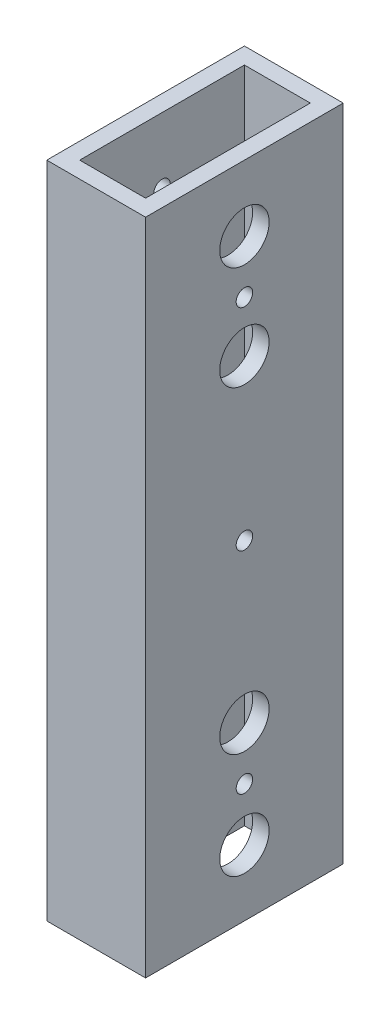
ISO-10303-21;
HEADER;
FILE_DESCRIPTION(('STEP AP214'),'2;1');
FILE_NAME('part.step','',(''),(''),'','','');
FILE_SCHEMA(('AUTOMOTIVE_DESIGN { 1 0 10303 214 1 1 1 1 }'));
ENDSEC;
DATA;
#1=APPLICATION_CONTEXT('core data for automotive mechanical design processes');
#2=APPLICATION_PROTOCOL_DEFINITION('international standard','automotive_design',2000,#1);
#3=PRODUCT_CONTEXT('',#1,'mechanical');
#4=PRODUCT('Part','Part','',(#3));
#5=PRODUCT_RELATED_PRODUCT_CATEGORY('part','',(#4));
#6=PRODUCT_DEFINITION_FORMATION('','',#4);
#7=PRODUCT_DEFINITION_CONTEXT('part definition',#1,'design');
#8=PRODUCT_DEFINITION('design','',#6,#7);
#9=PRODUCT_DEFINITION_SHAPE('','',#8);
#10=(LENGTH_UNIT() NAMED_UNIT(*) SI_UNIT(.MILLI.,.METRE.));
#11=(NAMED_UNIT(*) PLANE_ANGLE_UNIT() SI_UNIT($,.RADIAN.));
#12=(NAMED_UNIT(*) SI_UNIT($,.STERADIAN.) SOLID_ANGLE_UNIT());
#13=UNCERTAINTY_MEASURE_WITH_UNIT(LENGTH_MEASURE(1.E-05),#10,'distance_accuracy_value','');
#14=(GEOMETRIC_REPRESENTATION_CONTEXT(3) GLOBAL_UNCERTAINTY_ASSIGNED_CONTEXT((#13)) GLOBAL_UNIT_ASSIGNED_CONTEXT((#10,
#11,#12)) REPRESENTATION_CONTEXT('',''));
#15=CARTESIAN_POINT('',(0.,0.,0.));
#16=DIRECTION('',(0.,0.,1.));
#17=DIRECTION('',(1.,0.,0.));
#18=AXIS2_PLACEMENT_3D('',#15,#16,#17);
#19=CARTESIAN_POINT('',(0.,127.,0.));
#20=DIRECTION('',(0.,-1.,0.));
#21=DIRECTION('',(0.,0.,-1.));
#22=AXIS2_PLACEMENT_3D('',#19,#20,#21);
#23=PLANE('',#22);
#24=DIRECTION('',(0.,0.,1.));
#25=VECTOR('',#24,1.);
#26=CARTESIAN_POINT('',(0.,127.,0.));
#27=LINE('',#26,#25);
#28=CARTESIAN_POINT('',(0.,127.,-38.1));
#29=VERTEX_POINT('',#28);
#30=CARTESIAN_POINT('',(0.,127.,0.));
#31=VERTEX_POINT('',#30);
#32=EDGE_CURVE('E172',#29,#31,#27,.T.);
#33=ORIENTED_EDGE('',*,*,#32,.T.);
#34=DIRECTION('',(1.,0.,0.));
#35=VECTOR('',#34,1.);
#36=CARTESIAN_POINT('',(0.,127.,0.));
#37=LINE('',#36,#35);
#38=CARTESIAN_POINT('',(19.05,127.,0.));
#39=VERTEX_POINT('',#38);
#40=EDGE_CURVE('E176',#31,#39,#37,.T.);
#41=ORIENTED_EDGE('',*,*,#40,.T.);
#42=DIRECTION('',(0.,0.,-1.));
#43=VECTOR('',#42,1.);
#44=CARTESIAN_POINT('',(19.05,127.,0.));
#45=LINE('',#44,#43);
#46=CARTESIAN_POINT('',(19.05,127.,-38.1));
#47=VERTEX_POINT('',#46);
#48=EDGE_CURVE('E180',#39,#47,#45,.T.);
#49=ORIENTED_EDGE('',*,*,#48,.T.);
#50=DIRECTION('',(-1.,0.,0.));
#51=VECTOR('',#50,1.);
#52=CARTESIAN_POINT('',(0.,127.,-38.1));
#53=LINE('',#52,#51);
#54=EDGE_CURVE('E182',#47,#29,#53,.T.);
#55=ORIENTED_EDGE('',*,*,#54,.T.);
#56=EDGE_LOOP('',(#33,#41,#49,#55));
#57=FACE_BOUND('',#56,.T.);
#58=DIRECTION('',(0.,0.,1.));
#59=VECTOR('',#58,1.);
#60=CARTESIAN_POINT('',(3.175,127.,-3.175));
#61=LINE('',#60,#59);
#62=CARTESIAN_POINT('',(3.175,127.,-34.925));
#63=VERTEX_POINT('',#62);
#64=CARTESIAN_POINT('',(3.175,127.,-3.175));
#65=VERTEX_POINT('',#64);
#66=EDGE_CURVE('E122',#63,#65,#61,.T.);
#67=ORIENTED_EDGE('',*,*,#66,.F.);
#68=DIRECTION('',(-1.,0.,0.));
#69=VECTOR('',#68,1.);
#70=CARTESIAN_POINT('',(3.175,127.,-34.925));
#71=LINE('',#70,#69);
#72=CARTESIAN_POINT('',(15.875,127.,-34.925));
#73=VERTEX_POINT('',#72);
#74=EDGE_CURVE('E149',#73,#63,#71,.T.);
#75=ORIENTED_EDGE('',*,*,#74,.F.);
#76=DIRECTION('',(0.,0.,-1.));
#77=VECTOR('',#76,1.);
#78=CARTESIAN_POINT('',(15.875,127.,-3.175));
#79=LINE('',#78,#77);
#80=CARTESIAN_POINT('',(15.875,127.,-3.175));
#81=VERTEX_POINT('',#80);
#82=EDGE_CURVE('E144',#81,#73,#79,.T.);
#83=ORIENTED_EDGE('',*,*,#82,.F.);
#84=DIRECTION('',(1.,0.,0.));
#85=VECTOR('',#84,1.);
#86=CARTESIAN_POINT('',(3.175,127.,-3.175));
#87=LINE('',#86,#85);
#88=EDGE_CURVE('E131',#65,#81,#87,.T.);
#89=ORIENTED_EDGE('',*,*,#88,.F.);
#90=EDGE_LOOP('',(#67,#75,#83,#89));
#91=FACE_BOUND('',#90,.T.);
#92=ADVANCED_FACE('F42',(#57,#91),#23,.F.);
#93=CARTESIAN_POINT('',(0.,0.,0.));
#94=DIRECTION('',(0.,-1.,0.));
#95=DIRECTION('',(0.,0.,-1.));
#96=AXIS2_PLACEMENT_3D('',#93,#94,#95);
#97=PLANE('',#96);
#98=DIRECTION('',(0.,0.,1.));
#99=VECTOR('',#98,1.);
#100=CARTESIAN_POINT('',(0.,0.,0.));
#101=LINE('',#100,#99);
#102=CARTESIAN_POINT('',(0.,0.,-38.1));
#103=VERTEX_POINT('',#102);
#104=CARTESIAN_POINT('',(0.,0.,0.));
#105=VERTEX_POINT('',#104);
#106=EDGE_CURVE('E140',#103,#105,#101,.T.);
#107=ORIENTED_EDGE('',*,*,#106,.F.);
#108=DIRECTION('',(-1.,0.,0.));
#109=VECTOR('',#108,1.);
#110=CARTESIAN_POINT('',(0.,0.,-38.1));
#111=LINE('',#110,#109);
#112=CARTESIAN_POINT('',(19.05,0.,-38.1));
#113=VERTEX_POINT('',#112);
#114=EDGE_CURVE('E177',#113,#103,#111,.T.);
#115=ORIENTED_EDGE('',*,*,#114,.F.);
#116=DIRECTION('',(0.,0.,-1.));
#117=VECTOR('',#116,1.);
#118=CARTESIAN_POINT('',(19.05,0.,0.));
#119=LINE('',#118,#117);
#120=CARTESIAN_POINT('',(19.05,0.,0.));
#121=VERTEX_POINT('',#120);
#122=EDGE_CURVE('E191',#121,#113,#119,.T.);
#123=ORIENTED_EDGE('',*,*,#122,.F.);
#124=DIRECTION('',(1.,0.,0.));
#125=VECTOR('',#124,1.);
#126=CARTESIAN_POINT('',(0.,0.,0.));
#127=LINE('',#126,#125);
#128=EDGE_CURVE('E188',#105,#121,#127,.T.);
#129=ORIENTED_EDGE('',*,*,#128,.F.);
#130=EDGE_LOOP('',(#107,#115,#123,#129));
#131=FACE_BOUND('',#130,.T.);
#132=DIRECTION('',(-1.,0.,0.));
#133=VECTOR('',#132,1.);
#134=CARTESIAN_POINT('',(3.175,0.,-34.925));
#135=LINE('',#134,#133);
#136=CARTESIAN_POINT('',(15.875,0.,-34.925));
#137=VERTEX_POINT('',#136);
#138=CARTESIAN_POINT('',(3.175,0.,-34.925));
#139=VERTEX_POINT('',#138);
#140=EDGE_CURVE('E132',#137,#139,#135,.T.);
#141=ORIENTED_EDGE('',*,*,#140,.T.);
#142=DIRECTION('',(0.,0.,1.));
#143=VECTOR('',#142,1.);
#144=CARTESIAN_POINT('',(3.175,0.,-3.175));
#145=LINE('',#144,#143);
#146=CARTESIAN_POINT('',(3.175,0.,-3.175));
#147=VERTEX_POINT('',#146);
#148=EDGE_CURVE('E71',#139,#147,#145,.T.);
#149=ORIENTED_EDGE('',*,*,#148,.T.);
#150=DIRECTION('',(1.,0.,0.));
#151=VECTOR('',#150,1.);
#152=CARTESIAN_POINT('',(3.175,0.,-3.175));
#153=LINE('',#152,#151);
#154=CARTESIAN_POINT('',(15.875,0.,-3.175));
#155=VERTEX_POINT('',#154);
#156=EDGE_CURVE('E138',#147,#155,#153,.T.);
#157=ORIENTED_EDGE('',*,*,#156,.T.);
#158=DIRECTION('',(0.,0.,-1.));
#159=VECTOR('',#158,1.);
#160=CARTESIAN_POINT('',(15.875,0.,-3.175));
#161=LINE('',#160,#159);
#162=EDGE_CURVE('E159',#155,#137,#161,.T.);
#163=ORIENTED_EDGE('',*,*,#162,.T.);
#164=EDGE_LOOP('',(#141,#149,#157,#163));
#165=FACE_BOUND('',#164,.T.);
#166=ADVANCED_FACE('F289',(#131,#165),#97,.T.);
#167=CARTESIAN_POINT('',(0.,127.,0.));
#168=DIRECTION('',(1.,0.,0.));
#169=DIRECTION('',(0.,0.,-1.));
#170=AXIS2_PLACEMENT_3D('',#167,#168,#169);
#171=PLANE('',#170);
#172=CARTESIAN_POINT('',(0.,104.120295878924,-19.05));
#173=DIRECTION('',(-1.,0.,0.));
#174=DIRECTION('',(0.,0.,1.));
#175=AXIS2_PLACEMENT_3D('',#172,#173,#174);
#176=CIRCLE('',#175,4.7625);
#177=CARTESIAN_POINT('',(0.,104.120295878924,-14.2875));
#178=VERTEX_POINT('',#177);
#179=EDGE_CURVE('E387',#178,#178,#176,.T.);
#180=ORIENTED_EDGE('',*,*,#179,.F.);
#181=EDGE_LOOP('',(#180));
#182=FACE_BOUND('',#181,.T.);
#183=CARTESIAN_POINT('',(0.,63.5,-19.05));
#184=DIRECTION('',(-1.,0.,0.));
#185=DIRECTION('',(0.,0.,1.));
#186=AXIS2_PLACEMENT_3D('',#183,#184,#185);
#187=CIRCLE('',#186,4.7625);
#188=CARTESIAN_POINT('',(0.,63.5,-14.2875));
#189=VERTEX_POINT('',#188);
#190=EDGE_CURVE('E397',#189,#189,#187,.T.);
#191=ORIENTED_EDGE('',*,*,#190,.F.);
#192=EDGE_LOOP('',(#191));
#193=FACE_BOUND('',#192,.T.);
#194=CARTESIAN_POINT('',(0.,22.8797041210764,-19.05));
#195=DIRECTION('',(-1.,0.,0.));
#196=DIRECTION('',(0.,0.,1.));
#197=AXIS2_PLACEMENT_3D('',#194,#195,#196);
#198=CIRCLE('',#197,4.7625);
#199=CARTESIAN_POINT('',(0.,22.8797041210764,-14.2875));
#200=VERTEX_POINT('',#199);
#201=EDGE_CURVE('E407',#200,#200,#198,.T.);
#202=ORIENTED_EDGE('',*,*,#201,.F.);
#203=EDGE_LOOP('',(#202));
#204=FACE_BOUND('',#203,.T.);
#205=CARTESIAN_POINT('',(0.,12.7,-19.05));
#206=DIRECTION('',(1.,0.,0.));
#207=DIRECTION('',(0.,0.,-1.));
#208=AXIS2_PLACEMENT_3D('',#205,#206,#207);
#209=CIRCLE('',#208,1.5875);
#210=CARTESIAN_POINT('',(0.,12.7,-20.6375));
#211=VERTEX_POINT('',#210);
#212=EDGE_CURVE('E234',#211,#211,#209,.T.);
#213=ORIENTED_EDGE('',*,*,#212,.T.);
#214=EDGE_LOOP('',(#213));
#215=FACE_BOUND('',#214,.T.);
#216=CARTESIAN_POINT('',(0.,32.69996,-19.05));
#217=DIRECTION('',(1.,0.,0.));
#218=DIRECTION('',(0.,0.,-1.));
#219=AXIS2_PLACEMENT_3D('',#216,#217,#218);
#220=CIRCLE('',#219,1.5875);
#221=CARTESIAN_POINT('',(0.,32.69996,-20.6375));
#222=VERTEX_POINT('',#221);
#223=EDGE_CURVE('E239',#222,#222,#220,.T.);
#224=ORIENTED_EDGE('',*,*,#223,.T.);
#225=EDGE_LOOP('',(#224));
#226=FACE_BOUND('',#225,.T.);
#227=CARTESIAN_POINT('',(0.,94.30004,-19.05));
#228=DIRECTION('',(1.,0.,0.));
#229=DIRECTION('',(0.,0.,1.));
#230=AXIS2_PLACEMENT_3D('',#227,#228,#229);
#231=CIRCLE('',#230,1.5875);
#232=CARTESIAN_POINT('',(0.,94.30004,-17.4625));
#233=VERTEX_POINT('',#232);
#234=EDGE_CURVE('E243',#233,#233,#231,.T.);
#235=ORIENTED_EDGE('',*,*,#234,.T.);
#236=EDGE_LOOP('',(#235));
#237=FACE_BOUND('',#236,.T.);
#238=CARTESIAN_POINT('',(0.,114.3,-19.05));
#239=DIRECTION('',(1.,0.,0.));
#240=DIRECTION('',(0.,0.,1.));
#241=AXIS2_PLACEMENT_3D('',#238,#239,#240);
#242=CIRCLE('',#241,1.5875);
#243=CARTESIAN_POINT('',(0.,114.3,-17.4625));
#244=VERTEX_POINT('',#243);
#245=EDGE_CURVE('E246',#244,#244,#242,.T.);
#246=ORIENTED_EDGE('',*,*,#245,.T.);
#247=EDGE_LOOP('',(#246));
#248=FACE_BOUND('',#247,.T.);
#249=ORIENTED_EDGE('',*,*,#106,.T.);
#250=DIRECTION('',(0.,-1.,0.));
#251=VECTOR('',#250,1.);
#252=CARTESIAN_POINT('',(0.,127.,0.));
#253=LINE('',#252,#251);
#254=EDGE_CURVE('E11',#31,#105,#253,.T.);
#255=ORIENTED_EDGE('',*,*,#254,.F.);
#256=ORIENTED_EDGE('',*,*,#32,.F.);
#257=DIRECTION('',(0.,-1.,0.));
#258=VECTOR('',#257,1.);
#259=CARTESIAN_POINT('',(0.,127.,-38.1));
#260=LINE('',#259,#258);
#261=EDGE_CURVE('E184',#29,#103,#260,.T.);
#262=ORIENTED_EDGE('',*,*,#261,.T.);
#263=EDGE_LOOP('',(#249,#255,#256,#262));
#264=FACE_BOUND('',#263,.T.);
#265=ADVANCED_FACE('F44',(#182,#193,#204,#215,#226,#237,#248,#264),#171,.F.);
#266=CARTESIAN_POINT('',(0.,127.,0.));
#267=DIRECTION('',(0.,0.,-1.));
#268=DIRECTION('',(-1.,0.,0.));
#269=AXIS2_PLACEMENT_3D('',#266,#267,#268);
#270=PLANE('',#269);
#271=ORIENTED_EDGE('',*,*,#128,.T.);
#272=DIRECTION('',(0.,-1.,0.));
#273=VECTOR('',#272,1.);
#274=CARTESIAN_POINT('',(19.05,127.,0.));
#275=LINE('',#274,#273);
#276=EDGE_CURVE('E52',#39,#121,#275,.T.);
#277=ORIENTED_EDGE('',*,*,#276,.F.);
#278=ORIENTED_EDGE('',*,*,#40,.F.);
#279=ORIENTED_EDGE('',*,*,#254,.T.);
#280=EDGE_LOOP('',(#271,#277,#278,#279));
#281=FACE_BOUND('',#280,.T.);
#282=ADVANCED_FACE('F288',(#281),#270,.F.);
#283=CARTESIAN_POINT('',(19.05,127.,0.));
#284=DIRECTION('',(-1.,0.,0.));
#285=DIRECTION('',(0.,0.,1.));
#286=AXIS2_PLACEMENT_3D('',#283,#284,#285);
#287=PLANE('',#286);
#288=CARTESIAN_POINT('',(19.05,22.8797041210764,-19.05));
#289=DIRECTION('',(1.,0.,0.));
#290=DIRECTION('',(0.,0.,-1.));
#291=AXIS2_PLACEMENT_3D('',#288,#289,#290);
#292=CIRCLE('',#291,1.5875);
#293=CARTESIAN_POINT('',(19.05,22.8797041210764,-20.6375));
#294=VERTEX_POINT('',#293);
#295=EDGE_CURVE('E210',#294,#294,#292,.T.);
#296=ORIENTED_EDGE('',*,*,#295,.F.);
#297=EDGE_LOOP('',(#296));
#298=FACE_BOUND('',#297,.T.);
#299=CARTESIAN_POINT('',(19.05,63.5,-19.05));
#300=DIRECTION('',(1.,0.,0.));
#301=DIRECTION('',(0.,0.,-1.));
#302=AXIS2_PLACEMENT_3D('',#299,#300,#301);
#303=CIRCLE('',#302,1.5875);
#304=CARTESIAN_POINT('',(19.05,63.5,-20.6375));
#305=VERTEX_POINT('',#304);
#306=EDGE_CURVE('E394',#305,#305,#303,.T.);
#307=ORIENTED_EDGE('',*,*,#306,.F.);
#308=EDGE_LOOP('',(#307));
#309=FACE_BOUND('',#308,.T.);
#310=CARTESIAN_POINT('',(19.05,104.120295878924,-19.05));
#311=DIRECTION('',(1.,0.,0.));
#312=DIRECTION('',(0.,0.,1.));
#313=AXIS2_PLACEMENT_3D('',#310,#311,#312);
#314=CIRCLE('',#313,1.5875);
#315=CARTESIAN_POINT('',(19.05,104.120295878924,-17.4625));
#316=VERTEX_POINT('',#315);
#317=EDGE_CURVE('E389',#316,#316,#314,.T.);
#318=ORIENTED_EDGE('',*,*,#317,.F.);
#319=EDGE_LOOP('',(#318));
#320=FACE_BOUND('',#319,.T.);
#321=CARTESIAN_POINT('',(19.05,114.3,-19.05));
#322=DIRECTION('',(1.,0.,0.));
#323=DIRECTION('',(0.,0.,-1.));
#324=AXIS2_PLACEMENT_3D('',#321,#322,#323);
#325=CIRCLE('',#324,4.7625);
#326=CARTESIAN_POINT('',(19.05,114.3,-23.8125));
#327=VERTEX_POINT('',#326);
#328=EDGE_CURVE('E250',#327,#327,#325,.T.);
#329=ORIENTED_EDGE('',*,*,#328,.F.);
#330=EDGE_LOOP('',(#329));
#331=FACE_BOUND('',#330,.T.);
#332=CARTESIAN_POINT('',(19.05,94.30004,-19.05));
#333=DIRECTION('',(1.,0.,0.));
#334=DIRECTION('',(0.,0.,-1.));
#335=AXIS2_PLACEMENT_3D('',#332,#333,#334);
#336=CIRCLE('',#335,4.7625);
#337=CARTESIAN_POINT('',(19.05,94.30004,-23.8125));
#338=VERTEX_POINT('',#337);
#339=EDGE_CURVE('E427',#338,#338,#336,.T.);
#340=ORIENTED_EDGE('',*,*,#339,.F.);
#341=EDGE_LOOP('',(#340));
#342=FACE_BOUND('',#341,.T.);
#343=CARTESIAN_POINT('',(19.05,33.0594082421527,-19.05));
#344=DIRECTION('',(1.,0.,0.));
#345=DIRECTION('',(0.,0.,-1.));
#346=AXIS2_PLACEMENT_3D('',#343,#344,#345);
#347=CIRCLE('',#346,4.7625);
#348=CARTESIAN_POINT('',(19.05,33.0594082421527,-23.8125));
#349=VERTEX_POINT('',#348);
#350=EDGE_CURVE('E435',#349,#349,#347,.T.);
#351=ORIENTED_EDGE('',*,*,#350,.F.);
#352=EDGE_LOOP('',(#351));
#353=FACE_BOUND('',#352,.T.);
#354=CARTESIAN_POINT('',(19.05,12.7,-19.05));
#355=DIRECTION('',(1.,0.,0.));
#356=DIRECTION('',(0.,0.,-1.));
#357=AXIS2_PLACEMENT_3D('',#354,#355,#356);
#358=CIRCLE('',#357,4.7625);
#359=CARTESIAN_POINT('',(19.05,12.7,-23.8125));
#360=VERTEX_POINT('',#359);
#361=EDGE_CURVE('E224',#360,#360,#358,.T.);
#362=ORIENTED_EDGE('',*,*,#361,.F.);
#363=EDGE_LOOP('',(#362));
#364=FACE_BOUND('',#363,.T.);
#365=ORIENTED_EDGE('',*,*,#122,.T.);
#366=DIRECTION('',(0.,-1.,0.));
#367=VECTOR('',#366,1.);
#368=CARTESIAN_POINT('',(19.05,127.,-38.1));
#369=LINE('',#368,#367);
#370=EDGE_CURVE('E199',#47,#113,#369,.T.);
#371=ORIENTED_EDGE('',*,*,#370,.F.);
#372=ORIENTED_EDGE('',*,*,#48,.F.);
#373=ORIENTED_EDGE('',*,*,#276,.T.);
#374=EDGE_LOOP('',(#365,#371,#372,#373));
#375=FACE_BOUND('',#374,.T.);
#376=ADVANCED_FACE('F307',(#298,#309,#320,#331,#342,#353,#364,#375),#287,.F.);
#377=CARTESIAN_POINT('',(0.,127.,-38.1));
#378=DIRECTION('',(0.,0.,1.));
#379=DIRECTION('',(1.,0.,0.));
#380=AXIS2_PLACEMENT_3D('',#377,#378,#379);
#381=PLANE('',#380);
#382=ORIENTED_EDGE('',*,*,#114,.T.);
#383=ORIENTED_EDGE('',*,*,#261,.F.);
#384=ORIENTED_EDGE('',*,*,#54,.F.);
#385=ORIENTED_EDGE('',*,*,#370,.T.);
#386=EDGE_LOOP('',(#382,#383,#384,#385));
#387=FACE_BOUND('',#386,.T.);
#388=ADVANCED_FACE('F269',(#387),#381,.F.);
#389=CARTESIAN_POINT('',(3.175,127.,-3.175));
#390=DIRECTION('',(1.,0.,0.));
#391=DIRECTION('',(0.,0.,-1.));
#392=AXIS2_PLACEMENT_3D('',#389,#390,#391);
#393=PLANE('',#392);
#394=CARTESIAN_POINT('',(3.175,104.120295878924,-19.05));
#395=DIRECTION('',(1.,0.,0.));
#396=DIRECTION('',(0.,0.,-1.));
#397=AXIS2_PLACEMENT_3D('',#394,#395,#396);
#398=CIRCLE('',#397,4.7625);
#399=CARTESIAN_POINT('',(3.175,104.120295878924,-23.8125));
#400=VERTEX_POINT('',#399);
#401=EDGE_CURVE('E384',#400,#400,#398,.F.);
#402=ORIENTED_EDGE('',*,*,#401,.T.);
#403=EDGE_LOOP('',(#402));
#404=FACE_BOUND('',#403,.T.);
#405=CARTESIAN_POINT('',(3.175,63.5,-19.05));
#406=DIRECTION('',(1.,0.,0.));
#407=DIRECTION('',(0.,0.,-1.));
#408=AXIS2_PLACEMENT_3D('',#405,#406,#407);
#409=CIRCLE('',#408,4.7625);
#410=CARTESIAN_POINT('',(3.175,63.5,-23.8125));
#411=VERTEX_POINT('',#410);
#412=EDGE_CURVE('E403',#411,#411,#409,.F.);
#413=ORIENTED_EDGE('',*,*,#412,.T.);
#414=EDGE_LOOP('',(#413));
#415=FACE_BOUND('',#414,.T.);
#416=CARTESIAN_POINT('',(3.175,22.8797041210764,-19.05));
#417=DIRECTION('',(1.,0.,0.));
#418=DIRECTION('',(0.,0.,-1.));
#419=AXIS2_PLACEMENT_3D('',#416,#417,#418);
#420=CIRCLE('',#419,4.7625);
#421=CARTESIAN_POINT('',(3.175,22.8797041210764,-23.8125));
#422=VERTEX_POINT('',#421);
#423=EDGE_CURVE('E411',#422,#422,#420,.F.);
#424=ORIENTED_EDGE('',*,*,#423,.T.);
#425=EDGE_LOOP('',(#424));
#426=FACE_BOUND('',#425,.T.);
#427=CARTESIAN_POINT('',(3.175,12.7,-19.05));
#428=DIRECTION('',(1.,0.,0.));
#429=DIRECTION('',(0.,0.,-1.));
#430=AXIS2_PLACEMENT_3D('',#427,#428,#429);
#431=CIRCLE('',#430,1.5875);
#432=CARTESIAN_POINT('',(3.175,12.7,-20.6375));
#433=VERTEX_POINT('',#432);
#434=EDGE_CURVE('E156',#433,#433,#431,.T.);
#435=ORIENTED_EDGE('',*,*,#434,.F.);
#436=EDGE_LOOP('',(#435));
#437=FACE_BOUND('',#436,.T.);
#438=CARTESIAN_POINT('',(3.175,32.69996,-19.05));
#439=DIRECTION('',(1.,0.,0.));
#440=DIRECTION('',(0.,0.,-1.));
#441=AXIS2_PLACEMENT_3D('',#438,#439,#440);
#442=CIRCLE('',#441,1.5875);
#443=CARTESIAN_POINT('',(3.175,32.69996,-20.6375));
#444=VERTEX_POINT('',#443);
#445=EDGE_CURVE('E258',#444,#444,#442,.T.);
#446=ORIENTED_EDGE('',*,*,#445,.F.);
#447=EDGE_LOOP('',(#446));
#448=FACE_BOUND('',#447,.T.);
#449=CARTESIAN_POINT('',(3.175,94.30004,-19.05));
#450=DIRECTION('',(1.,0.,0.));
#451=DIRECTION('',(0.,0.,-1.));
#452=AXIS2_PLACEMENT_3D('',#449,#450,#451);
#453=CIRCLE('',#452,1.5875);
#454=CARTESIAN_POINT('',(3.175,94.30004,-20.6375));
#455=VERTEX_POINT('',#454);
#456=EDGE_CURVE('E254',#455,#455,#453,.T.);
#457=ORIENTED_EDGE('',*,*,#456,.F.);
#458=EDGE_LOOP('',(#457));
#459=FACE_BOUND('',#458,.T.);
#460=CARTESIAN_POINT('',(3.175,114.3,-19.05));
#461=DIRECTION('',(1.,0.,0.));
#462=DIRECTION('',(0.,0.,-1.));
#463=AXIS2_PLACEMENT_3D('',#460,#461,#462);
#464=CIRCLE('',#463,1.5875);
#465=CARTESIAN_POINT('',(3.175,114.3,-20.6375));
#466=VERTEX_POINT('',#465);
#467=EDGE_CURVE('E238',#466,#466,#464,.T.);
#468=ORIENTED_EDGE('',*,*,#467,.F.);
#469=EDGE_LOOP('',(#468));
#470=FACE_BOUND('',#469,.T.);
#471=ORIENTED_EDGE('',*,*,#148,.F.);
#472=DIRECTION('',(0.,-1.,0.));
#473=VECTOR('',#472,1.);
#474=CARTESIAN_POINT('',(3.175,127.,-34.925));
#475=LINE('',#474,#473);
#476=EDGE_CURVE('E126',#63,#139,#475,.T.);
#477=ORIENTED_EDGE('',*,*,#476,.F.);
#478=ORIENTED_EDGE('',*,*,#66,.T.);
#479=DIRECTION('',(0.,-1.,0.));
#480=VECTOR('',#479,1.);
#481=CARTESIAN_POINT('',(3.175,127.,-3.175));
#482=LINE('',#481,#480);
#483=EDGE_CURVE('E125',#65,#147,#482,.T.);
#484=ORIENTED_EDGE('',*,*,#483,.T.);
#485=EDGE_LOOP('',(#471,#477,#478,#484));
#486=FACE_BOUND('',#485,.T.);
#487=ADVANCED_FACE('F124',(#404,#415,#426,#437,#448,#459,#470,#486),#393,.T.);
#488=CARTESIAN_POINT('',(3.175,127.,-3.175));
#489=DIRECTION('',(0.,0.,-1.));
#490=DIRECTION('',(-1.,0.,0.));
#491=AXIS2_PLACEMENT_3D('',#488,#489,#490);
#492=PLANE('',#491);
#493=ORIENTED_EDGE('',*,*,#156,.F.);
#494=ORIENTED_EDGE('',*,*,#483,.F.);
#495=ORIENTED_EDGE('',*,*,#88,.T.);
#496=DIRECTION('',(0.,-1.,0.));
#497=VECTOR('',#496,1.);
#498=CARTESIAN_POINT('',(15.875,127.,-3.175));
#499=LINE('',#498,#497);
#500=EDGE_CURVE('E141',#81,#155,#499,.T.);
#501=ORIENTED_EDGE('',*,*,#500,.T.);
#502=EDGE_LOOP('',(#493,#494,#495,#501));
#503=FACE_BOUND('',#502,.T.);
#504=ADVANCED_FACE('F135',(#503),#492,.T.);
#505=CARTESIAN_POINT('',(15.875,127.,-3.175));
#506=DIRECTION('',(-1.,0.,0.));
#507=DIRECTION('',(0.,0.,1.));
#508=AXIS2_PLACEMENT_3D('',#505,#506,#507);
#509=PLANE('',#508);
#510=CARTESIAN_POINT('',(15.875,22.8797041210764,-19.05));
#511=DIRECTION('',(-1.,0.,0.));
#512=DIRECTION('',(0.,0.,1.));
#513=AXIS2_PLACEMENT_3D('',#510,#511,#512);
#514=CIRCLE('',#513,1.5875);
#515=CARTESIAN_POINT('',(15.875,22.8797041210764,-17.4625));
#516=VERTEX_POINT('',#515);
#517=EDGE_CURVE('E46',#516,#516,#514,.T.);
#518=ORIENTED_EDGE('',*,*,#517,.F.);
#519=EDGE_LOOP('',(#518));
#520=FACE_BOUND('',#519,.T.);
#521=CARTESIAN_POINT('',(15.875,63.5,-19.05));
#522=DIRECTION('',(-1.,0.,0.));
#523=DIRECTION('',(0.,0.,1.));
#524=AXIS2_PLACEMENT_3D('',#521,#522,#523);
#525=CIRCLE('',#524,1.5875);
#526=CARTESIAN_POINT('',(15.875,63.5,-17.4625));
#527=VERTEX_POINT('',#526);
#528=EDGE_CURVE('E209',#527,#527,#525,.T.);
#529=ORIENTED_EDGE('',*,*,#528,.F.);
#530=EDGE_LOOP('',(#529));
#531=FACE_BOUND('',#530,.T.);
#532=CARTESIAN_POINT('',(15.875,104.120295878924,-19.05));
#533=DIRECTION('',(-1.,0.,0.));
#534=DIRECTION('',(0.,0.,1.));
#535=AXIS2_PLACEMENT_3D('',#532,#533,#534);
#536=CIRCLE('',#535,1.5875);
#537=CARTESIAN_POINT('',(15.875,104.120295878924,-17.4625));
#538=VERTEX_POINT('',#537);
#539=EDGE_CURVE('E206',#538,#538,#536,.T.);
#540=ORIENTED_EDGE('',*,*,#539,.F.);
#541=EDGE_LOOP('',(#540));
#542=FACE_BOUND('',#541,.T.);
#543=CARTESIAN_POINT('',(15.875,114.3,-19.05));
#544=DIRECTION('',(-1.,0.,0.));
#545=DIRECTION('',(0.,0.,1.));
#546=AXIS2_PLACEMENT_3D('',#543,#544,#545);
#547=CIRCLE('',#546,4.7625);
#548=CARTESIAN_POINT('',(15.875,114.3,-14.2875));
#549=VERTEX_POINT('',#548);
#550=EDGE_CURVE('E423',#549,#549,#547,.F.);
#551=ORIENTED_EDGE('',*,*,#550,.T.);
#552=EDGE_LOOP('',(#551));
#553=FACE_BOUND('',#552,.T.);
#554=CARTESIAN_POINT('',(15.875,94.30004,-19.05));
#555=DIRECTION('',(-1.,0.,0.));
#556=DIRECTION('',(0.,0.,1.));
#557=AXIS2_PLACEMENT_3D('',#554,#555,#556);
#558=CIRCLE('',#557,4.7625);
#559=CARTESIAN_POINT('',(15.875,94.30004,-14.2875));
#560=VERTEX_POINT('',#559);
#561=EDGE_CURVE('E431',#560,#560,#558,.F.);
#562=ORIENTED_EDGE('',*,*,#561,.T.);
#563=EDGE_LOOP('',(#562));
#564=FACE_BOUND('',#563,.T.);
#565=CARTESIAN_POINT('',(15.875,33.0594082421527,-19.05));
#566=DIRECTION('',(-1.,0.,0.));
#567=DIRECTION('',(0.,0.,1.));
#568=AXIS2_PLACEMENT_3D('',#565,#566,#567);
#569=CIRCLE('',#568,4.7625);
#570=CARTESIAN_POINT('',(15.875,33.0594082421527,-14.2875));
#571=VERTEX_POINT('',#570);
#572=EDGE_CURVE('E230',#571,#571,#569,.F.);
#573=ORIENTED_EDGE('',*,*,#572,.T.);
#574=EDGE_LOOP('',(#573));
#575=FACE_BOUND('',#574,.T.);
#576=CARTESIAN_POINT('',(15.875,12.7,-19.05));
#577=DIRECTION('',(-1.,0.,0.));
#578=DIRECTION('',(0.,0.,1.));
#579=AXIS2_PLACEMENT_3D('',#576,#577,#578);
#580=CIRCLE('',#579,4.7625);
#581=CARTESIAN_POINT('',(15.875,12.7,-14.2875));
#582=VERTEX_POINT('',#581);
#583=EDGE_CURVE('E218',#582,#582,#580,.F.);
#584=ORIENTED_EDGE('',*,*,#583,.T.);
#585=EDGE_LOOP('',(#584));
#586=FACE_BOUND('',#585,.T.);
#587=ORIENTED_EDGE('',*,*,#162,.F.);
#588=ORIENTED_EDGE('',*,*,#500,.F.);
#589=ORIENTED_EDGE('',*,*,#82,.T.);
#590=DIRECTION('',(0.,-1.,0.));
#591=VECTOR('',#590,1.);
#592=CARTESIAN_POINT('',(15.875,127.,-34.925));
#593=LINE('',#592,#591);
#594=EDGE_CURVE('E60',#73,#137,#593,.T.);
#595=ORIENTED_EDGE('',*,*,#594,.T.);
#596=EDGE_LOOP('',(#587,#588,#589,#595));
#597=FACE_BOUND('',#596,.T.);
#598=ADVANCED_FACE('F327',(#520,#531,#542,#553,#564,#575,#586,#597),#509,.T.);
#599=CARTESIAN_POINT('',(3.175,127.,-34.925));
#600=DIRECTION('',(0.,0.,1.));
#601=DIRECTION('',(1.,0.,0.));
#602=AXIS2_PLACEMENT_3D('',#599,#600,#601);
#603=PLANE('',#602);
#604=ORIENTED_EDGE('',*,*,#140,.F.);
#605=ORIENTED_EDGE('',*,*,#594,.F.);
#606=ORIENTED_EDGE('',*,*,#74,.T.);
#607=ORIENTED_EDGE('',*,*,#476,.T.);
#608=EDGE_LOOP('',(#604,#605,#606,#607));
#609=FACE_BOUND('',#608,.T.);
#610=ADVANCED_FACE('F282',(#609),#603,.T.);
#611=CARTESIAN_POINT('',(0.,114.3,-19.05));
#612=DIRECTION('',(1.,0.,0.));
#613=DIRECTION('',(0.,0.,-1.));
#614=AXIS2_PLACEMENT_3D('',#611,#612,#613);
#615=CYLINDRICAL_SURFACE('',#614,1.5875);
#616=ORIENTED_EDGE('',*,*,#467,.T.);
#617=EDGE_LOOP('',(#616));
#618=FACE_BOUND('',#617,.T.);
#619=ORIENTED_EDGE('',*,*,#245,.F.);
#620=EDGE_LOOP('',(#619));
#621=FACE_BOUND('',#620,.T.);
#622=ADVANCED_FACE('F278',(#618,#621),#615,.F.);
#623=CARTESIAN_POINT('',(0.,94.30004,-19.05));
#624=DIRECTION('',(1.,0.,0.));
#625=DIRECTION('',(0.,0.,-1.));
#626=AXIS2_PLACEMENT_3D('',#623,#624,#625);
#627=CYLINDRICAL_SURFACE('',#626,1.5875);
#628=ORIENTED_EDGE('',*,*,#456,.T.);
#629=EDGE_LOOP('',(#628));
#630=FACE_BOUND('',#629,.T.);
#631=ORIENTED_EDGE('',*,*,#234,.F.);
#632=EDGE_LOOP('',(#631));
#633=FACE_BOUND('',#632,.T.);
#634=ADVANCED_FACE('F281',(#630,#633),#627,.F.);
#635=CARTESIAN_POINT('',(0.,32.69996,-19.05));
#636=DIRECTION('',(1.,0.,0.));
#637=DIRECTION('',(0.,0.,-1.));
#638=AXIS2_PLACEMENT_3D('',#635,#636,#637);
#639=CYLINDRICAL_SURFACE('',#638,1.5875);
#640=ORIENTED_EDGE('',*,*,#445,.T.);
#641=EDGE_LOOP('',(#640));
#642=FACE_BOUND('',#641,.T.);
#643=ORIENTED_EDGE('',*,*,#223,.F.);
#644=EDGE_LOOP('',(#643));
#645=FACE_BOUND('',#644,.T.);
#646=ADVANCED_FACE('F335',(#642,#645),#639,.F.);
#647=CARTESIAN_POINT('',(0.,12.7,-19.05));
#648=DIRECTION('',(1.,0.,0.));
#649=DIRECTION('',(0.,0.,-1.));
#650=AXIS2_PLACEMENT_3D('',#647,#648,#649);
#651=CYLINDRICAL_SURFACE('',#650,1.5875);
#652=ORIENTED_EDGE('',*,*,#434,.T.);
#653=EDGE_LOOP('',(#652));
#654=FACE_BOUND('',#653,.T.);
#655=ORIENTED_EDGE('',*,*,#212,.F.);
#656=EDGE_LOOP('',(#655));
#657=FACE_BOUND('',#656,.T.);
#658=ADVANCED_FACE('F264',(#654,#657),#651,.F.);
#659=CARTESIAN_POINT('',(-0.001000000000001,12.7,-19.05));
#660=DIRECTION('',(1.,0.,0.));
#661=DIRECTION('',(0.,0.,-1.));
#662=AXIS2_PLACEMENT_3D('',#659,#660,#661);
#663=CYLINDRICAL_SURFACE('',#662,4.7625);
#664=ORIENTED_EDGE('',*,*,#583,.F.);
#665=EDGE_LOOP('',(#664));
#666=FACE_BOUND('',#665,.T.);
#667=ORIENTED_EDGE('',*,*,#361,.T.);
#668=EDGE_LOOP('',(#667));
#669=FACE_BOUND('',#668,.T.);
#670=ADVANCED_FACE('F342',(#666,#669),#663,.F.);
#671=CARTESIAN_POINT('',(-0.001000000000001,33.0594082421527,-19.05));
#672=DIRECTION('',(1.,0.,0.));
#673=DIRECTION('',(0.,0.,-1.));
#674=AXIS2_PLACEMENT_3D('',#671,#672,#673);
#675=CYLINDRICAL_SURFACE('',#674,4.7625);
#676=ORIENTED_EDGE('',*,*,#572,.F.);
#677=EDGE_LOOP('',(#676));
#678=FACE_BOUND('',#677,.T.);
#679=ORIENTED_EDGE('',*,*,#350,.T.);
#680=EDGE_LOOP('',(#679));
#681=FACE_BOUND('',#680,.T.);
#682=ADVANCED_FACE('F345',(#678,#681),#675,.F.);
#683=CARTESIAN_POINT('',(-0.001000000000001,94.30004,-19.05));
#684=DIRECTION('',(1.,0.,0.));
#685=DIRECTION('',(0.,0.,-1.));
#686=AXIS2_PLACEMENT_3D('',#683,#684,#685);
#687=CYLINDRICAL_SURFACE('',#686,4.7625);
#688=ORIENTED_EDGE('',*,*,#561,.F.);
#689=EDGE_LOOP('',(#688));
#690=FACE_BOUND('',#689,.T.);
#691=ORIENTED_EDGE('',*,*,#339,.T.);
#692=EDGE_LOOP('',(#691));
#693=FACE_BOUND('',#692,.T.);
#694=ADVANCED_FACE('F349',(#690,#693),#687,.F.);
#695=CARTESIAN_POINT('',(-0.001000000000001,114.3,-19.05));
#696=DIRECTION('',(1.,0.,0.));
#697=DIRECTION('',(0.,0.,-1.));
#698=AXIS2_PLACEMENT_3D('',#695,#696,#697);
#699=CYLINDRICAL_SURFACE('',#698,4.7625);
#700=ORIENTED_EDGE('',*,*,#550,.F.);
#701=EDGE_LOOP('',(#700));
#702=FACE_BOUND('',#701,.T.);
#703=ORIENTED_EDGE('',*,*,#328,.T.);
#704=EDGE_LOOP('',(#703));
#705=FACE_BOUND('',#704,.T.);
#706=ADVANCED_FACE('F353',(#702,#705),#699,.F.);
#707=CARTESIAN_POINT('',(0.,104.120295878924,-19.05));
#708=DIRECTION('',(1.,0.,0.));
#709=DIRECTION('',(0.,0.,-1.));
#710=AXIS2_PLACEMENT_3D('',#707,#708,#709);
#711=CYLINDRICAL_SURFACE('',#710,1.5875);
#712=ORIENTED_EDGE('',*,*,#539,.T.);
#713=EDGE_LOOP('',(#712));
#714=FACE_BOUND('',#713,.T.);
#715=ORIENTED_EDGE('',*,*,#317,.T.);
#716=EDGE_LOOP('',(#715));
#717=FACE_BOUND('',#716,.T.);
#718=ADVANCED_FACE('F357',(#714,#717),#711,.F.);
#719=CARTESIAN_POINT('',(0.,63.5,-19.05));
#720=DIRECTION('',(1.,0.,0.));
#721=DIRECTION('',(0.,0.,-1.));
#722=AXIS2_PLACEMENT_3D('',#719,#720,#721);
#723=CYLINDRICAL_SURFACE('',#722,1.5875);
#724=ORIENTED_EDGE('',*,*,#528,.T.);
#725=EDGE_LOOP('',(#724));
#726=FACE_BOUND('',#725,.T.);
#727=ORIENTED_EDGE('',*,*,#306,.T.);
#728=EDGE_LOOP('',(#727));
#729=FACE_BOUND('',#728,.T.);
#730=ADVANCED_FACE('F361',(#726,#729),#723,.F.);
#731=CARTESIAN_POINT('',(0.,22.8797041210764,-19.05));
#732=DIRECTION('',(1.,0.,0.));
#733=DIRECTION('',(0.,0.,-1.));
#734=AXIS2_PLACEMENT_3D('',#731,#732,#733);
#735=CYLINDRICAL_SURFACE('',#734,1.5875);
#736=ORIENTED_EDGE('',*,*,#517,.T.);
#737=EDGE_LOOP('',(#736));
#738=FACE_BOUND('',#737,.T.);
#739=ORIENTED_EDGE('',*,*,#295,.T.);
#740=EDGE_LOOP('',(#739));
#741=FACE_BOUND('',#740,.T.);
#742=ADVANCED_FACE('F365',(#738,#741),#735,.F.);
#743=CARTESIAN_POINT('',(19.051,22.8797041210764,-19.05));
#744=DIRECTION('',(-1.,0.,0.));
#745=DIRECTION('',(0.,0.,1.));
#746=AXIS2_PLACEMENT_3D('',#743,#744,#745);
#747=CYLINDRICAL_SURFACE('',#746,4.7625);
#748=ORIENTED_EDGE('',*,*,#423,.F.);
#749=EDGE_LOOP('',(#748));
#750=FACE_BOUND('',#749,.T.);
#751=ORIENTED_EDGE('',*,*,#201,.T.);
#752=EDGE_LOOP('',(#751));
#753=FACE_BOUND('',#752,.T.);
#754=ADVANCED_FACE('F368',(#750,#753),#747,.F.);
#755=CARTESIAN_POINT('',(19.051,63.5,-19.05));
#756=DIRECTION('',(-1.,0.,0.));
#757=DIRECTION('',(0.,0.,1.));
#758=AXIS2_PLACEMENT_3D('',#755,#756,#757);
#759=CYLINDRICAL_SURFACE('',#758,4.7625);
#760=ORIENTED_EDGE('',*,*,#412,.F.);
#761=EDGE_LOOP('',(#760));
#762=FACE_BOUND('',#761,.T.);
#763=ORIENTED_EDGE('',*,*,#190,.T.);
#764=EDGE_LOOP('',(#763));
#765=FACE_BOUND('',#764,.T.);
#766=ADVANCED_FACE('F371',(#762,#765),#759,.F.);
#767=CARTESIAN_POINT('',(19.051,104.120295878924,-19.05));
#768=DIRECTION('',(-1.,0.,0.));
#769=DIRECTION('',(0.,0.,1.));
#770=AXIS2_PLACEMENT_3D('',#767,#768,#769);
#771=CYLINDRICAL_SURFACE('',#770,4.7625);
#772=ORIENTED_EDGE('',*,*,#401,.F.);
#773=EDGE_LOOP('',(#772));
#774=FACE_BOUND('',#773,.T.);
#775=ORIENTED_EDGE('',*,*,#179,.T.);
#776=EDGE_LOOP('',(#775));
#777=FACE_BOUND('',#776,.T.);
#778=ADVANCED_FACE('F375',(#774,#777),#771,.F.);
#779=CLOSED_SHELL('',(#92,#166,#265,#282,#376,#388,#487,#504,#598,#610,#622,#634,#646,#658,#670,
#682,#694,#706,#718,#730,#742,#754,#766,#778));
#780=MANIFOLD_SOLID_BREP('B2',#779);
#781=ADVANCED_BREP_SHAPE_REPRESENTATION('',(#18,#780),#14);
#782=SHAPE_DEFINITION_REPRESENTATION(#9,#781);
ENDSEC;
END-ISO-10303-21;
